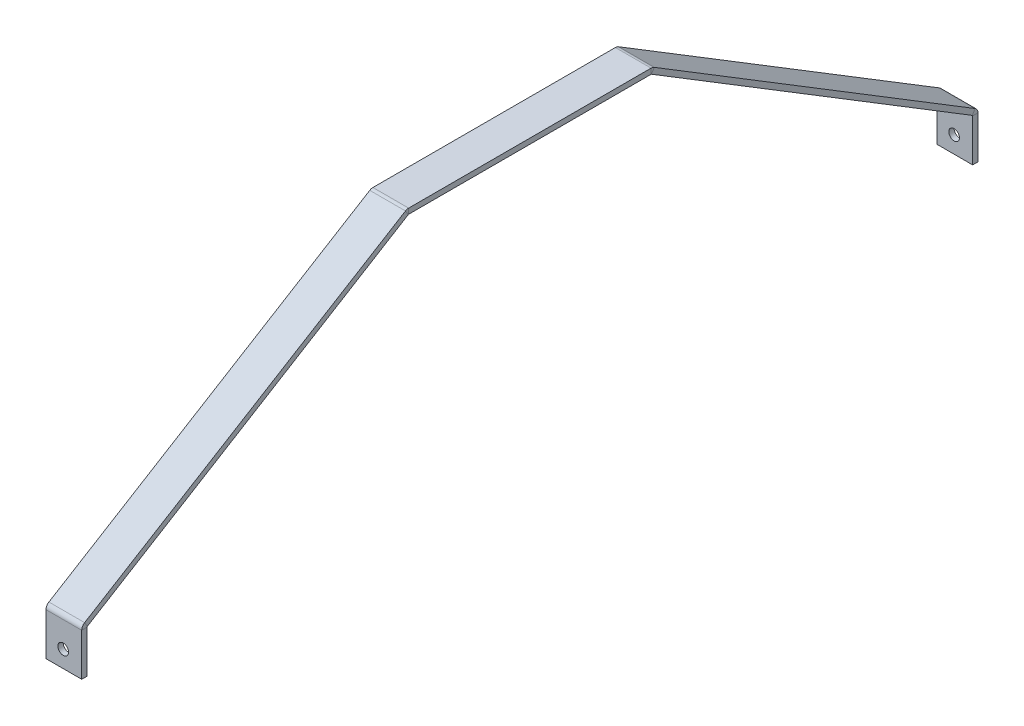
ISO-10303-21;
HEADER;
FILE_DESCRIPTION(('STEP AP214'),'2;1');
FILE_NAME('part.step','',(''),(''),'','','');
FILE_SCHEMA(('AUTOMOTIVE_DESIGN { 1 0 10303 214 1 1 1 1 }'));
ENDSEC;
DATA;
#1=APPLICATION_CONTEXT('core data for automotive mechanical design processes');
#2=APPLICATION_PROTOCOL_DEFINITION('international standard','automotive_design',2000,#1);
#3=PRODUCT_CONTEXT('',#1,'mechanical');
#4=PRODUCT('Part','Part','',(#3));
#5=PRODUCT_RELATED_PRODUCT_CATEGORY('part','',(#4));
#6=PRODUCT_DEFINITION_FORMATION('','',#4);
#7=PRODUCT_DEFINITION_CONTEXT('part definition',#1,'design');
#8=PRODUCT_DEFINITION('design','',#6,#7);
#9=PRODUCT_DEFINITION_SHAPE('','',#8);
#10=(LENGTH_UNIT() NAMED_UNIT(*) SI_UNIT(.MILLI.,.METRE.));
#11=(NAMED_UNIT(*) PLANE_ANGLE_UNIT() SI_UNIT($,.RADIAN.));
#12=(NAMED_UNIT(*) SI_UNIT($,.STERADIAN.) SOLID_ANGLE_UNIT());
#13=UNCERTAINTY_MEASURE_WITH_UNIT(LENGTH_MEASURE(1.E-05),#10,'distance_accuracy_value','');
#14=(GEOMETRIC_REPRESENTATION_CONTEXT(3) GLOBAL_UNCERTAINTY_ASSIGNED_CONTEXT((#13)) GLOBAL_UNIT_ASSIGNED_CONTEXT((#10,
#11,#12)) REPRESENTATION_CONTEXT('',''));
#15=CARTESIAN_POINT('',(0.,0.,0.));
#16=DIRECTION('',(0.,0.,1.));
#17=DIRECTION('',(1.,0.,0.));
#18=AXIS2_PLACEMENT_3D('',#15,#16,#17);
#19=CARTESIAN_POINT('',(10.,-54.941510556711,-123.904290001891));
#20=DIRECTION('',(1.,0.,0.));
#21=DIRECTION('',(0.,0.,-1.));
#22=AXIS2_PLACEMENT_3D('',#19,#20,#21);
#23=PLANE('',#22);
#24=DIRECTION('',(0.,0.853281833651962,-0.52145000945397));
#25=VECTOR('',#24,1.);
#26=CARTESIAN_POINT('',(10.,-54.941510556711,-123.904290001891));
#27=LINE('',#26,#25);
#28=CARTESIAN_POINT('',(10.,-54.941510556711,-123.904290001891));
#29=VERTEX_POINT('',#28);
#30=CARTESIAN_POINT('',(10.,-53.6615878062331,-124.686465016072));
#31=VERTEX_POINT('',#30);
#32=EDGE_CURVE('E11',#29,#31,#27,.T.);
#33=ORIENTED_EDGE('',*,*,#32,.F.);
#34=CARTESIAN_POINT('',(10.,-55.1121669234414,-123.8));
#35=DIRECTION('',(-1.,0.,0.));
#36=DIRECTION('',(0.,0.,1.));
#37=AXIS2_PLACEMENT_3D('',#34,#35,#36);
#38=CIRCLE('',#37,0.2);
#39=CARTESIAN_POINT('',(10.,-55.1121669234414,-124.));
#40=VERTEX_POINT('',#39);
#41=EDGE_CURVE('E366',#40,#29,#38,.F.);
#42=ORIENTED_EDGE('',*,*,#41,.F.);
#43=DIRECTION('',(0.,0.,1.));
#44=VECTOR('',#43,1.);
#45=CARTESIAN_POINT('',(10.,-55.1121669234414,-125.5));
#46=LINE('',#45,#44);
#47=CARTESIAN_POINT('',(10.,-55.1121669234414,-125.5));
#48=VERTEX_POINT('',#47);
#49=EDGE_CURVE('E44',#48,#40,#46,.T.);
#50=ORIENTED_EDGE('',*,*,#49,.F.);
#51=CARTESIAN_POINT('',(10.,-55.1121669234414,-123.8));
#52=DIRECTION('',(1.,0.,0.));
#53=DIRECTION('',(0.,0.,-1.));
#54=AXIS2_PLACEMENT_3D('',#51,#52,#53);
#55=CIRCLE('',#54,1.7);
#56=EDGE_CURVE('E379',#48,#31,#55,.T.);
#57=ORIENTED_EDGE('',*,*,#56,.T.);
#58=EDGE_LOOP('',(#33,#42,#50,#57));
#59=FACE_BOUND('',#58,.T.);
#60=ADVANCED_FACE('F36',(#59),#23,.T.);
#61=CARTESIAN_POINT('',(10.,-55.1121669234414,-125.5));
#62=DIRECTION('',(1.,0.,0.));
#63=DIRECTION('',(0.,0.,-1.));
#64=AXIS2_PLACEMENT_3D('',#61,#62,#63);
#65=PLANE('',#64);
#66=DIRECTION('',(0.,0.521450009453975,0.853281833651959));
#67=VECTOR('',#66,1.);
#68=CARTESIAN_POINT('',(10.,0.,-34.));
#69=LINE('',#68,#67);
#70=CARTESIAN_POINT('',(10.,-0.029343633269607,-34.0480168544412));
#71=VERTEX_POINT('',#70);
#72=EDGE_CURVE('E370',#29,#71,#69,.T.);
#73=ORIENTED_EDGE('',*,*,#72,.F.);
#74=ORIENTED_EDGE('',*,*,#32,.T.);
#75=DIRECTION('',(0.,0.521450009453975,0.853281833651959));
#76=VECTOR('',#75,1.);
#77=CARTESIAN_POINT('',(10.,1.27992275047794,-34.782175014181));
#78=LINE('',#77,#76);
#79=CARTESIAN_POINT('',(10.,1.25057911720834,-34.8301918686221));
#80=VERTEX_POINT('',#79);
#81=EDGE_CURVE('E381',#31,#80,#78,.T.);
#82=ORIENTED_EDGE('',*,*,#81,.T.);
#83=DIRECTION('',(0.,-0.853281833651964,0.521450009453967));
#84=VECTOR('',#83,1.);
#85=CARTESIAN_POINT('',(10.,1.25057911720834,-34.8301918686221));
#86=LINE('',#85,#84);
#87=EDGE_CURVE('E340',#80,#71,#86,.T.);
#88=ORIENTED_EDGE('',*,*,#87,.T.);
#89=EDGE_LOOP('',(#73,#74,#82,#88));
#90=FACE_BOUND('',#89,.T.);
#91=ADVANCED_FACE('F451',(#90),#65,.T.);
#92=CARTESIAN_POINT('',(0.,-55.1121669234414,-124.));
#93=DIRECTION('',(-1.,0.,0.));
#94=DIRECTION('',(0.,0.,1.));
#95=AXIS2_PLACEMENT_3D('',#92,#93,#94);
#96=PLANE('',#95);
#97=DIRECTION('',(0.,0.,-1.));
#98=VECTOR('',#97,1.);
#99=CARTESIAN_POINT('',(0.,-55.1121669234414,-124.));
#100=LINE('',#99,#98);
#101=CARTESIAN_POINT('',(0.,-55.1121669234414,-124.));
#102=VERTEX_POINT('',#101);
#103=CARTESIAN_POINT('',(0.,-55.1121669234414,-125.5));
#104=VERTEX_POINT('',#103);
#105=EDGE_CURVE('E346',#102,#104,#100,.T.);
#106=ORIENTED_EDGE('',*,*,#105,.F.);
#107=CARTESIAN_POINT('',(0.,-55.1121669234414,-123.8));
#108=DIRECTION('',(-1.,0.,0.));
#109=DIRECTION('',(0.,0.,1.));
#110=AXIS2_PLACEMENT_3D('',#107,#108,#109);
#111=CIRCLE('',#110,0.2);
#112=CARTESIAN_POINT('',(0.,-54.941510556711,-123.904290001891));
#113=VERTEX_POINT('',#112);
#114=EDGE_CURVE('E250',#102,#113,#111,.F.);
#115=ORIENTED_EDGE('',*,*,#114,.T.);
#116=DIRECTION('',(0.,-0.853281833651962,0.52145000945397));
#117=VECTOR('',#116,1.);
#118=CARTESIAN_POINT('',(0.,-53.6615878062331,-124.686465016072));
#119=LINE('',#118,#117);
#120=CARTESIAN_POINT('',(0.,-53.6615878062331,-124.686465016072));
#121=VERTEX_POINT('',#120);
#122=EDGE_CURVE('E344',#121,#113,#119,.T.);
#123=ORIENTED_EDGE('',*,*,#122,.F.);
#124=CARTESIAN_POINT('',(0.,-55.1121669234414,-123.8));
#125=DIRECTION('',(1.,0.,0.));
#126=DIRECTION('',(0.,0.,-1.));
#127=AXIS2_PLACEMENT_3D('',#124,#125,#126);
#128=CIRCLE('',#127,1.7);
#129=EDGE_CURVE('E262',#104,#121,#128,.T.);
#130=ORIENTED_EDGE('',*,*,#129,.F.);
#131=EDGE_LOOP('',(#106,#115,#123,#130));
#132=FACE_BOUND('',#131,.T.);
#133=ADVANCED_FACE('F493',(#132),#96,.T.);
#134=CARTESIAN_POINT('',(0.,-53.6615878062331,-124.686465016072));
#135=DIRECTION('',(-1.,0.,0.));
#136=DIRECTION('',(0.,0.,1.));
#137=AXIS2_PLACEMENT_3D('',#134,#135,#136);
#138=PLANE('',#137);
#139=DIRECTION('',(0.,1.,0.));
#140=VECTOR('',#139,1.);
#141=CARTESIAN_POINT('',(0.,-55.,-124.));
#142=LINE('',#141,#140);
#143=CARTESIAN_POINT('',(0.,-67.,-124.));
#144=VERTEX_POINT('',#143);
#145=EDGE_CURVE('E253',#144,#102,#142,.T.);
#146=ORIENTED_EDGE('',*,*,#145,.T.);
#147=ORIENTED_EDGE('',*,*,#105,.T.);
#148=DIRECTION('',(0.,1.,0.));
#149=VECTOR('',#148,1.);
#150=CARTESIAN_POINT('',(0.,-55.,-125.5));
#151=LINE('',#150,#149);
#152=CARTESIAN_POINT('',(0.,-67.,-125.5));
#153=VERTEX_POINT('',#152);
#154=EDGE_CURVE('E259',#153,#104,#151,.T.);
#155=ORIENTED_EDGE('',*,*,#154,.F.);
#156=DIRECTION('',(0.,0.,1.));
#157=VECTOR('',#156,1.);
#158=CARTESIAN_POINT('',(0.,-67.,-125.5));
#159=LINE('',#158,#157);
#160=EDGE_CURVE('E256',#153,#144,#159,.T.);
#161=ORIENTED_EDGE('',*,*,#160,.T.);
#162=EDGE_LOOP('',(#146,#147,#155,#161));
#163=FACE_BOUND('',#162,.T.);
#164=ADVANCED_FACE('F497',(#163),#138,.T.);
#165=CARTESIAN_POINT('',(10.,0.,-33.9437268525504));
#166=DIRECTION('',(1.,0.,0.));
#167=DIRECTION('',(0.,0.,-1.));
#168=AXIS2_PLACEMENT_3D('',#165,#166,#167);
#169=PLANE('',#168);
#170=DIRECTION('',(0.,1.,0.));
#171=VECTOR('',#170,1.);
#172=CARTESIAN_POINT('',(10.,0.,-33.9437268525504));
#173=LINE('',#172,#171);
#174=CARTESIAN_POINT('',(10.,0.,-33.9437268525504));
#175=VERTEX_POINT('',#174);
#176=CARTESIAN_POINT('',(10.,1.5,-33.9437268525504));
#177=VERTEX_POINT('',#176);
#178=EDGE_CURVE('E342',#175,#177,#173,.T.);
#179=ORIENTED_EDGE('',*,*,#178,.F.);
#180=CARTESIAN_POINT('',(10.,-0.199999999999999,-33.9437268525504));
#181=DIRECTION('',(-1.,0.,0.));
#182=DIRECTION('',(0.,0.,1.));
#183=AXIS2_PLACEMENT_3D('',#180,#181,#182);
#184=CIRCLE('',#183,0.2);
#185=EDGE_CURVE('E441',#71,#175,#184,.F.);
#186=ORIENTED_EDGE('',*,*,#185,.F.);
#187=ORIENTED_EDGE('',*,*,#87,.F.);
#188=CARTESIAN_POINT('',(10.,-0.199999999999999,-33.9437268525504));
#189=DIRECTION('',(1.,0.,0.));
#190=DIRECTION('',(0.,0.,-1.));
#191=AXIS2_PLACEMENT_3D('',#188,#189,#190);
#192=CIRCLE('',#191,1.7);
#193=EDGE_CURVE('E384',#80,#177,#192,.T.);
#194=ORIENTED_EDGE('',*,*,#193,.T.);
#195=EDGE_LOOP('',(#179,#186,#187,#194));
#196=FACE_BOUND('',#195,.T.);
#197=ADVANCED_FACE('F458',(#196),#169,.T.);
#198=CARTESIAN_POINT('',(10.,1.25057911720834,-34.8301918686221));
#199=DIRECTION('',(1.,0.,0.));
#200=DIRECTION('',(0.,0.,-1.));
#201=AXIS2_PLACEMENT_3D('',#198,#199,#200);
#202=PLANE('',#201);
#203=DIRECTION('',(0.,0.,1.));
#204=VECTOR('',#203,1.);
#205=CARTESIAN_POINT('',(10.,0.,-34.));
#206=LINE('',#205,#204);
#207=CARTESIAN_POINT('',(10.,0.,33.9437268525504));
#208=VERTEX_POINT('',#207);
#209=EDGE_CURVE('E438',#175,#208,#206,.T.);
#210=ORIENTED_EDGE('',*,*,#209,.F.);
#211=ORIENTED_EDGE('',*,*,#178,.T.);
#212=DIRECTION('',(0.,0.,1.));
#213=VECTOR('',#212,1.);
#214=CARTESIAN_POINT('',(10.,1.5,-34.));
#215=LINE('',#214,#213);
#216=CARTESIAN_POINT('',(10.,1.49999999999999,33.9437268525504));
#217=VERTEX_POINT('',#216);
#218=EDGE_CURVE('E203',#177,#217,#215,.T.);
#219=ORIENTED_EDGE('',*,*,#218,.T.);
#220=DIRECTION('',(0.,-1.,0.));
#221=VECTOR('',#220,1.);
#222=CARTESIAN_POINT('',(10.,1.49999999999999,33.9437268525504));
#223=LINE('',#222,#221);
#224=EDGE_CURVE('E194',#217,#208,#223,.T.);
#225=ORIENTED_EDGE('',*,*,#224,.T.);
#226=EDGE_LOOP('',(#210,#211,#219,#225));
#227=FACE_BOUND('',#226,.T.);
#228=ADVANCED_FACE('F390',(#227),#202,.T.);
#229=CARTESIAN_POINT('',(0.,-0.029343633269607,-34.0480168544412));
#230=DIRECTION('',(-1.,0.,0.));
#231=DIRECTION('',(0.,0.,1.));
#232=AXIS2_PLACEMENT_3D('',#229,#230,#231);
#233=PLANE('',#232);
#234=DIRECTION('',(0.,0.853281833651964,-0.521450009453967));
#235=VECTOR('',#234,1.);
#236=CARTESIAN_POINT('',(0.,-0.029343633269607,-34.0480168544412));
#237=LINE('',#236,#235);
#238=CARTESIAN_POINT('',(0.,-0.029343633269607,-34.0480168544412));
#239=VERTEX_POINT('',#238);
#240=CARTESIAN_POINT('',(0.,1.25057911720834,-34.8301918686221));
#241=VERTEX_POINT('',#240);
#242=EDGE_CURVE('E338',#239,#241,#237,.T.);
#243=ORIENTED_EDGE('',*,*,#242,.F.);
#244=CARTESIAN_POINT('',(0.,-0.199999999999999,-33.9437268525504));
#245=DIRECTION('',(-1.,0.,0.));
#246=DIRECTION('',(0.,0.,1.));
#247=AXIS2_PLACEMENT_3D('',#244,#245,#246);
#248=CIRCLE('',#247,0.2);
#249=CARTESIAN_POINT('',(0.,0.,-33.9437268525504));
#250=VERTEX_POINT('',#249);
#251=EDGE_CURVE('E244',#239,#250,#248,.F.);
#252=ORIENTED_EDGE('',*,*,#251,.T.);
#253=DIRECTION('',(0.,-1.,0.));
#254=VECTOR('',#253,1.);
#255=CARTESIAN_POINT('',(0.,1.5,-33.9437268525504));
#256=LINE('',#255,#254);
#257=CARTESIAN_POINT('',(0.,1.5,-33.9437268525504));
#258=VERTEX_POINT('',#257);
#259=EDGE_CURVE('E193',#258,#250,#256,.T.);
#260=ORIENTED_EDGE('',*,*,#259,.F.);
#261=CARTESIAN_POINT('',(0.,-0.199999999999999,-33.9437268525504));
#262=DIRECTION('',(1.,0.,0.));
#263=DIRECTION('',(0.,0.,-1.));
#264=AXIS2_PLACEMENT_3D('',#261,#262,#263);
#265=CIRCLE('',#264,1.7);
#266=EDGE_CURVE('E268',#241,#258,#265,.T.);
#267=ORIENTED_EDGE('',*,*,#266,.F.);
#268=EDGE_LOOP('',(#243,#252,#260,#267));
#269=FACE_BOUND('',#268,.T.);
#270=ADVANCED_FACE('F467',(#269),#233,.T.);
#271=CARTESIAN_POINT('',(0.,1.5,-33.9437268525504));
#272=DIRECTION('',(-1.,0.,0.));
#273=DIRECTION('',(0.,0.,1.));
#274=AXIS2_PLACEMENT_3D('',#271,#272,#273);
#275=PLANE('',#274);
#276=DIRECTION('',(0.,0.521450009453975,0.853281833651959));
#277=VECTOR('',#276,1.);
#278=CARTESIAN_POINT('',(0.,0.,-34.));
#279=LINE('',#278,#277);
#280=EDGE_CURVE('E247',#113,#239,#279,.T.);
#281=ORIENTED_EDGE('',*,*,#280,.T.);
#282=ORIENTED_EDGE('',*,*,#242,.T.);
#283=DIRECTION('',(0.,0.521450009453975,0.853281833651959));
#284=VECTOR('',#283,1.);
#285=CARTESIAN_POINT('',(0.,1.27992275047794,-34.782175014181));
#286=LINE('',#285,#284);
#287=EDGE_CURVE('E265',#121,#241,#286,.T.);
#288=ORIENTED_EDGE('',*,*,#287,.F.);
#289=ORIENTED_EDGE('',*,*,#122,.T.);
#290=EDGE_LOOP('',(#281,#282,#288,#289));
#291=FACE_BOUND('',#290,.T.);
#292=ADVANCED_FACE('F471',(#291),#275,.T.);
#293=CARTESIAN_POINT('',(10.,-0.0293436332696236,34.0480168544412));
#294=DIRECTION('',(1.,0.,0.));
#295=DIRECTION('',(0.,0.,-1.));
#296=AXIS2_PLACEMENT_3D('',#293,#294,#295);
#297=PLANE('',#296);
#298=DIRECTION('',(0.,0.853281833651958,0.521450009453976));
#299=VECTOR('',#298,1.);
#300=CARTESIAN_POINT('',(10.,-0.0293436332696236,34.0480168544412));
#301=LINE('',#300,#299);
#302=CARTESIAN_POINT('',(10.,-0.0293436332696236,34.0480168544412));
#303=VERTEX_POINT('',#302);
#304=CARTESIAN_POINT('',(10.,1.25057911720831,34.8301918686222));
#305=VERTEX_POINT('',#304);
#306=EDGE_CURVE('E181',#303,#305,#301,.T.);
#307=ORIENTED_EDGE('',*,*,#306,.F.);
#308=CARTESIAN_POINT('',(10.,-0.200000000000013,33.9437268525504));
#309=DIRECTION('',(-1.,0.,0.));
#310=DIRECTION('',(0.,0.,1.));
#311=AXIS2_PLACEMENT_3D('',#308,#309,#310);
#312=CIRCLE('',#311,0.2);
#313=EDGE_CURVE('E402',#208,#303,#312,.F.);
#314=ORIENTED_EDGE('',*,*,#313,.F.);
#315=ORIENTED_EDGE('',*,*,#224,.F.);
#316=CARTESIAN_POINT('',(10.,-0.200000000000013,33.9437268525504));
#317=DIRECTION('',(1.,0.,0.));
#318=DIRECTION('',(0.,0.,-1.));
#319=AXIS2_PLACEMENT_3D('',#316,#317,#318);
#320=CIRCLE('',#319,1.7);
#321=EDGE_CURVE('E197',#217,#305,#320,.T.);
#322=ORIENTED_EDGE('',*,*,#321,.T.);
#323=EDGE_LOOP('',(#307,#314,#315,#322));
#324=FACE_BOUND('',#323,.T.);
#325=ADVANCED_FACE('F199',(#324),#297,.T.);
#326=CARTESIAN_POINT('',(10.,1.49999999999999,33.9437268525504));
#327=DIRECTION('',(1.,0.,0.));
#328=DIRECTION('',(0.,0.,-1.));
#329=AXIS2_PLACEMENT_3D('',#326,#327,#328);
#330=PLANE('',#329);
#331=DIRECTION('',(0.,-0.521450009453975,0.853281833651959));
#332=VECTOR('',#331,1.);
#333=CARTESIAN_POINT('',(10.,0.,34.));
#334=LINE('',#333,#332);
#335=CARTESIAN_POINT('',(10.,-54.941510556711,123.904290001891));
#336=VERTEX_POINT('',#335);
#337=EDGE_CURVE('E188',#303,#336,#334,.T.);
#338=ORIENTED_EDGE('',*,*,#337,.F.);
#339=ORIENTED_EDGE('',*,*,#306,.T.);
#340=DIRECTION('',(0.,-0.521450009453975,0.853281833651959));
#341=VECTOR('',#340,1.);
#342=CARTESIAN_POINT('',(10.,1.27992275047793,34.782175014181));
#343=LINE('',#342,#341);
#344=CARTESIAN_POINT('',(10.,-53.6615878062331,124.686465016072));
#345=VERTEX_POINT('',#344);
#346=EDGE_CURVE('E185',#305,#345,#343,.T.);
#347=ORIENTED_EDGE('',*,*,#346,.T.);
#348=DIRECTION('',(0.,-0.853281833651974,-0.521450009453951));
#349=VECTOR('',#348,1.);
#350=CARTESIAN_POINT('',(10.,-53.6615878062331,124.686465016072));
#351=LINE('',#350,#349);
#352=EDGE_CURVE('E329',#345,#336,#351,.T.);
#353=ORIENTED_EDGE('',*,*,#352,.T.);
#354=EDGE_LOOP('',(#338,#339,#347,#353));
#355=FACE_BOUND('',#354,.T.);
#356=ADVANCED_FACE('F183',(#355),#330,.T.);
#357=CARTESIAN_POINT('',(0.,0.,33.9437268525504));
#358=DIRECTION('',(-1.,0.,0.));
#359=DIRECTION('',(0.,0.,1.));
#360=AXIS2_PLACEMENT_3D('',#357,#358,#359);
#361=PLANE('',#360);
#362=DIRECTION('',(0.,1.,0.));
#363=VECTOR('',#362,1.);
#364=CARTESIAN_POINT('',(0.,0.,33.9437268525504));
#365=LINE('',#364,#363);
#366=CARTESIAN_POINT('',(0.,0.,33.9437268525504));
#367=VERTEX_POINT('',#366);
#368=CARTESIAN_POINT('',(0.,1.49999999999999,33.9437268525504));
#369=VERTEX_POINT('',#368);
#370=EDGE_CURVE('E334',#367,#369,#365,.T.);
#371=ORIENTED_EDGE('',*,*,#370,.F.);
#372=CARTESIAN_POINT('',(0.,-0.200000000000013,33.9437268525504));
#373=DIRECTION('',(-1.,0.,0.));
#374=DIRECTION('',(0.,0.,1.));
#375=AXIS2_PLACEMENT_3D('',#372,#373,#374);
#376=CIRCLE('',#375,0.2);
#377=CARTESIAN_POINT('',(0.,-0.0293436332696236,34.0480168544412));
#378=VERTEX_POINT('',#377);
#379=EDGE_CURVE('E238',#367,#378,#376,.F.);
#380=ORIENTED_EDGE('',*,*,#379,.T.);
#381=DIRECTION('',(0.,-0.853281833651958,-0.521450009453976));
#382=VECTOR('',#381,1.);
#383=CARTESIAN_POINT('',(0.,1.25057911720831,34.8301918686222));
#384=LINE('',#383,#382);
#385=CARTESIAN_POINT('',(0.,1.25057911720831,34.8301918686222));
#386=VERTEX_POINT('',#385);
#387=EDGE_CURVE('E332',#386,#378,#384,.T.);
#388=ORIENTED_EDGE('',*,*,#387,.F.);
#389=CARTESIAN_POINT('',(0.,-0.200000000000013,33.9437268525504));
#390=DIRECTION('',(1.,0.,0.));
#391=DIRECTION('',(0.,0.,-1.));
#392=AXIS2_PLACEMENT_3D('',#389,#390,#391);
#393=CIRCLE('',#392,1.7);
#394=EDGE_CURVE('E210',#369,#386,#393,.T.);
#395=ORIENTED_EDGE('',*,*,#394,.F.);
#396=EDGE_LOOP('',(#371,#380,#388,#395));
#397=FACE_BOUND('',#396,.T.);
#398=ADVANCED_FACE('F396',(#397),#361,.T.);
#399=CARTESIAN_POINT('',(0.,1.25057911720831,34.8301918686222));
#400=DIRECTION('',(-1.,0.,0.));
#401=DIRECTION('',(0.,0.,1.));
#402=AXIS2_PLACEMENT_3D('',#399,#400,#401);
#403=PLANE('',#402);
#404=DIRECTION('',(0.,0.,1.));
#405=VECTOR('',#404,1.);
#406=CARTESIAN_POINT('',(0.,0.,-34.));
#407=LINE('',#406,#405);
#408=EDGE_CURVE('E241',#250,#367,#407,.T.);
#409=ORIENTED_EDGE('',*,*,#408,.T.);
#410=ORIENTED_EDGE('',*,*,#370,.T.);
#411=DIRECTION('',(0.,0.,1.));
#412=VECTOR('',#411,1.);
#413=CARTESIAN_POINT('',(0.,1.5,-34.));
#414=LINE('',#413,#412);
#415=EDGE_CURVE('E271',#258,#369,#414,.T.);
#416=ORIENTED_EDGE('',*,*,#415,.F.);
#417=ORIENTED_EDGE('',*,*,#259,.T.);
#418=EDGE_LOOP('',(#409,#410,#416,#417));
#419=FACE_BOUND('',#418,.T.);
#420=ADVANCED_FACE('F477',(#419),#403,.T.);
#421=CARTESIAN_POINT('',(10.,-55.1121669234414,124.));
#422=DIRECTION('',(1.,0.,0.));
#423=DIRECTION('',(0.,0.,-1.));
#424=AXIS2_PLACEMENT_3D('',#421,#422,#423);
#425=PLANE('',#424);
#426=DIRECTION('',(0.,0.,1.));
#427=VECTOR('',#426,1.);
#428=CARTESIAN_POINT('',(10.,-55.1121669234414,124.));
#429=LINE('',#428,#427);
#430=CARTESIAN_POINT('',(10.,-55.1121669234414,124.));
#431=VERTEX_POINT('',#430);
#432=CARTESIAN_POINT('',(10.,-55.1121669234414,125.5));
#433=VERTEX_POINT('',#432);
#434=EDGE_CURVE('E52',#431,#433,#429,.T.);
#435=ORIENTED_EDGE('',*,*,#434,.F.);
#436=CARTESIAN_POINT('',(10.,-55.1121669234414,123.8));
#437=DIRECTION('',(-1.,0.,0.));
#438=DIRECTION('',(0.,0.,1.));
#439=AXIS2_PLACEMENT_3D('',#436,#437,#438);
#440=CIRCLE('',#439,0.2);
#441=EDGE_CURVE('E430',#336,#431,#440,.F.);
#442=ORIENTED_EDGE('',*,*,#441,.F.);
#443=ORIENTED_EDGE('',*,*,#352,.F.);
#444=CARTESIAN_POINT('',(10.,-55.1121669234414,123.8));
#445=DIRECTION('',(1.,0.,0.));
#446=DIRECTION('',(0.,0.,-1.));
#447=AXIS2_PLACEMENT_3D('',#444,#445,#446);
#448=CIRCLE('',#447,1.7);
#449=EDGE_CURVE('E218',#345,#433,#448,.T.);
#450=ORIENTED_EDGE('',*,*,#449,.T.);
#451=EDGE_LOOP('',(#435,#442,#443,#450));
#452=FACE_BOUND('',#451,.T.);
#453=ADVANCED_FACE('F479',(#452),#425,.T.);
#454=CARTESIAN_POINT('',(10.,-53.6615878062331,124.686465016072));
#455=DIRECTION('',(1.,0.,0.));
#456=DIRECTION('',(0.,0.,-1.));
#457=AXIS2_PLACEMENT_3D('',#454,#455,#456);
#458=PLANE('',#457);
#459=DIRECTION('',(0.,-1.,0.));
#460=VECTOR('',#459,1.);
#461=CARTESIAN_POINT('',(10.,-55.,124.));
#462=LINE('',#461,#460);
#463=CARTESIAN_POINT('',(10.,-67.,124.));
#464=VERTEX_POINT('',#463);
#465=EDGE_CURVE('E428',#431,#464,#462,.T.);
#466=ORIENTED_EDGE('',*,*,#465,.F.);
#467=ORIENTED_EDGE('',*,*,#434,.T.);
#468=DIRECTION('',(0.,1.,0.));
#469=VECTOR('',#468,1.);
#470=CARTESIAN_POINT('',(10.,-55.,125.5));
#471=LINE('',#470,#469);
#472=CARTESIAN_POINT('',(10.,-67.,125.5));
#473=VERTEX_POINT('',#472);
#474=EDGE_CURVE('E130',#433,#473,#471,.F.);
#475=ORIENTED_EDGE('',*,*,#474,.T.);
#476=DIRECTION('',(0.,0.,1.));
#477=VECTOR('',#476,1.);
#478=CARTESIAN_POINT('',(10.,-67.,124.));
#479=LINE('',#478,#477);
#480=EDGE_CURVE('E426',#464,#473,#479,.T.);
#481=ORIENTED_EDGE('',*,*,#480,.F.);
#482=EDGE_LOOP('',(#466,#467,#475,#481));
#483=FACE_BOUND('',#482,.T.);
#484=ADVANCED_FACE('F485',(#483),#458,.T.);
#485=CARTESIAN_POINT('',(0.,-54.941510556711,123.904290001891));
#486=DIRECTION('',(-1.,0.,0.));
#487=DIRECTION('',(0.,0.,1.));
#488=AXIS2_PLACEMENT_3D('',#485,#486,#487);
#489=PLANE('',#488);
#490=DIRECTION('',(0.,0.853281833651974,0.521450009453951));
#491=VECTOR('',#490,1.);
#492=CARTESIAN_POINT('',(0.,-54.941510556711,123.904290001891));
#493=LINE('',#492,#491);
#494=CARTESIAN_POINT('',(0.,-54.941510556711,123.904290001891));
#495=VERTEX_POINT('',#494);
#496=CARTESIAN_POINT('',(0.,-53.6615878062331,124.686465016072));
#497=VERTEX_POINT('',#496);
#498=EDGE_CURVE('E117',#495,#497,#493,.T.);
#499=ORIENTED_EDGE('',*,*,#498,.F.);
#500=CARTESIAN_POINT('',(0.,-55.1121669234414,123.8));
#501=DIRECTION('',(-1.,0.,0.));
#502=DIRECTION('',(0.,0.,1.));
#503=AXIS2_PLACEMENT_3D('',#500,#501,#502);
#504=CIRCLE('',#503,0.2);
#505=CARTESIAN_POINT('',(0.,-55.1121669234414,124.));
#506=VERTEX_POINT('',#505);
#507=EDGE_CURVE('E234',#495,#506,#504,.F.);
#508=ORIENTED_EDGE('',*,*,#507,.T.);
#509=DIRECTION('',(0.,0.,-1.));
#510=VECTOR('',#509,1.);
#511=CARTESIAN_POINT('',(0.,-55.1121669234414,125.5));
#512=LINE('',#511,#510);
#513=CARTESIAN_POINT('',(0.,-55.1121669234414,125.5));
#514=VERTEX_POINT('',#513);
#515=EDGE_CURVE('E124',#514,#506,#512,.T.);
#516=ORIENTED_EDGE('',*,*,#515,.F.);
#517=CARTESIAN_POINT('',(0.,-55.1121669234414,123.8));
#518=DIRECTION('',(1.,0.,0.));
#519=DIRECTION('',(0.,0.,-1.));
#520=AXIS2_PLACEMENT_3D('',#517,#518,#519);
#521=CIRCLE('',#520,1.7);
#522=EDGE_CURVE('E277',#497,#514,#521,.T.);
#523=ORIENTED_EDGE('',*,*,#522,.F.);
#524=EDGE_LOOP('',(#499,#508,#516,#523));
#525=FACE_BOUND('',#524,.T.);
#526=ADVANCED_FACE('F413',(#525),#489,.T.);
#527=CARTESIAN_POINT('',(0.,-55.1121669234414,125.5));
#528=DIRECTION('',(-1.,0.,0.));
#529=DIRECTION('',(0.,0.,1.));
#530=AXIS2_PLACEMENT_3D('',#527,#528,#529);
#531=PLANE('',#530);
#532=DIRECTION('',(0.,-0.521450009453975,0.853281833651959));
#533=VECTOR('',#532,1.);
#534=CARTESIAN_POINT('',(0.,0.,34.));
#535=LINE('',#534,#533);
#536=EDGE_CURVE('E236',#378,#495,#535,.T.);
#537=ORIENTED_EDGE('',*,*,#536,.T.);
#538=ORIENTED_EDGE('',*,*,#498,.T.);
#539=DIRECTION('',(0.,-0.521450009453975,0.853281833651959));
#540=VECTOR('',#539,1.);
#541=CARTESIAN_POINT('',(0.,1.27992275047793,34.782175014181));
#542=LINE('',#541,#540);
#543=EDGE_CURVE('E275',#386,#497,#542,.T.);
#544=ORIENTED_EDGE('',*,*,#543,.F.);
#545=ORIENTED_EDGE('',*,*,#387,.T.);
#546=EDGE_LOOP('',(#537,#538,#544,#545));
#547=FACE_BOUND('',#546,.T.);
#548=ADVANCED_FACE('F398',(#547),#531,.T.);
#549=CARTESIAN_POINT('',(10.,-55.,125.5));
#550=DIRECTION('',(0.,0.,-1.));
#551=DIRECTION('',(-1.,0.,0.));
#552=AXIS2_PLACEMENT_3D('',#549,#550,#551);
#553=PLANE('',#552);
#554=CARTESIAN_POINT('',(4.82317135708357,-62.280383367042,125.5));
#555=DIRECTION('',(0.,0.,1.));
#556=DIRECTION('',(1.,0.,0.));
#557=AXIS2_PLACEMENT_3D('',#554,#555,#556);
#558=CIRCLE('',#557,1.5);
#559=CARTESIAN_POINT('',(6.32317135708357,-62.280383367042,125.5));
#560=VERTEX_POINT('',#559);
#561=EDGE_CURVE('E901',#560,#560,#558,.T.);
#562=ORIENTED_EDGE('',*,*,#561,.F.);
#563=EDGE_LOOP('',(#562));
#564=FACE_BOUND('',#563,.T.);
#565=DIRECTION('',(0.,1.,0.));
#566=VECTOR('',#565,1.);
#567=CARTESIAN_POINT('',(0.,-55.,125.5));
#568=LINE('',#567,#566);
#569=CARTESIAN_POINT('',(0.,-67.,125.5));
#570=VERTEX_POINT('',#569);
#571=EDGE_CURVE('E224',#514,#570,#568,.F.);
#572=ORIENTED_EDGE('',*,*,#571,.T.);
#573=DIRECTION('',(-1.,0.,0.));
#574=VECTOR('',#573,1.);
#575=CARTESIAN_POINT('',(10.,-67.,125.5));
#576=LINE('',#575,#574);
#577=EDGE_CURVE('E325',#473,#570,#576,.T.);
#578=ORIENTED_EDGE('',*,*,#577,.F.);
#579=ORIENTED_EDGE('',*,*,#474,.F.);
#580=DIRECTION('',(-1.,0.,0.));
#581=VECTOR('',#580,1.);
#582=CARTESIAN_POINT('',(10.,-55.1121669234414,125.5));
#583=LINE('',#582,#581);
#584=EDGE_CURVE('E220',#433,#514,#583,.T.);
#585=ORIENTED_EDGE('',*,*,#584,.T.);
#586=EDGE_LOOP('',(#572,#578,#579,#585));
#587=FACE_BOUND('',#586,.T.);
#588=ADVANCED_FACE('F419',(#564,#587),#553,.F.);
#589=CARTESIAN_POINT('',(10.,-67.,124.));
#590=DIRECTION('',(0.,-1.,0.));
#591=DIRECTION('',(0.,0.,-1.));
#592=AXIS2_PLACEMENT_3D('',#589,#590,#591);
#593=PLANE('',#592);
#594=DIRECTION('',(0.,0.,1.));
#595=VECTOR('',#594,1.);
#596=CARTESIAN_POINT('',(0.,-67.,124.));
#597=LINE('',#596,#595);
#598=CARTESIAN_POINT('',(0.,-67.,124.));
#599=VERTEX_POINT('',#598);
#600=EDGE_CURVE('E227',#599,#570,#597,.T.);
#601=ORIENTED_EDGE('',*,*,#600,.F.);
#602=DIRECTION('',(-1.,0.,0.));
#603=VECTOR('',#602,1.);
#604=CARTESIAN_POINT('',(10.,-67.,124.));
#605=LINE('',#604,#603);
#606=EDGE_CURVE('E323',#464,#599,#605,.T.);
#607=ORIENTED_EDGE('',*,*,#606,.F.);
#608=ORIENTED_EDGE('',*,*,#480,.T.);
#609=ORIENTED_EDGE('',*,*,#577,.T.);
#610=EDGE_LOOP('',(#601,#607,#608,#609));
#611=FACE_BOUND('',#610,.T.);
#612=ADVANCED_FACE('F424',(#611),#593,.T.);
#613=CARTESIAN_POINT('',(10.,-55.,124.));
#614=DIRECTION('',(0.,0.,-1.));
#615=DIRECTION('',(-1.,0.,0.));
#616=AXIS2_PLACEMENT_3D('',#613,#614,#615);
#617=PLANE('',#616);
#618=CARTESIAN_POINT('',(4.82317135708357,-62.280383367042,124.));
#619=DIRECTION('',(0.,0.,-1.));
#620=DIRECTION('',(-1.,0.,0.));
#621=AXIS2_PLACEMENT_3D('',#618,#619,#620);
#622=CIRCLE('',#621,1.5);
#623=CARTESIAN_POINT('',(3.32317135708357,-62.280383367042,124.));
#624=VERTEX_POINT('',#623);
#625=EDGE_CURVE('E228',#624,#624,#622,.T.);
#626=ORIENTED_EDGE('',*,*,#625,.F.);
#627=EDGE_LOOP('',(#626));
#628=FACE_BOUND('',#627,.T.);
#629=DIRECTION('',(0.,-1.,0.));
#630=VECTOR('',#629,1.);
#631=CARTESIAN_POINT('',(0.,-55.,124.));
#632=LINE('',#631,#630);
#633=EDGE_CURVE('E231',#506,#599,#632,.T.);
#634=ORIENTED_EDGE('',*,*,#633,.F.);
#635=DIRECTION('',(-1.,0.,0.));
#636=VECTOR('',#635,1.);
#637=CARTESIAN_POINT('',(10.,-55.1121669234414,124.));
#638=LINE('',#637,#636);
#639=EDGE_CURVE('E320',#431,#506,#638,.T.);
#640=ORIENTED_EDGE('',*,*,#639,.F.);
#641=ORIENTED_EDGE('',*,*,#465,.T.);
#642=ORIENTED_EDGE('',*,*,#606,.T.);
#643=EDGE_LOOP('',(#634,#640,#641,#642));
#644=FACE_BOUND('',#643,.T.);
#645=ADVANCED_FACE('F574',(#628,#644),#617,.T.);
#646=CARTESIAN_POINT('',(10.,-55.1121669234414,123.8));
#647=DIRECTION('',(-1.,0.,0.));
#648=DIRECTION('',(0.,0.,1.));
#649=AXIS2_PLACEMENT_3D('',#646,#647,#648);
#650=CYLINDRICAL_SURFACE('',#649,0.2);
#651=ORIENTED_EDGE('',*,*,#507,.F.);
#652=DIRECTION('',(-1.,0.,0.));
#653=VECTOR('',#652,1.);
#654=CARTESIAN_POINT('',(10.,-54.941510556711,123.904290001891));
#655=LINE('',#654,#653);
#656=EDGE_CURVE('E317',#336,#495,#655,.T.);
#657=ORIENTED_EDGE('',*,*,#656,.F.);
#658=ORIENTED_EDGE('',*,*,#441,.T.);
#659=ORIENTED_EDGE('',*,*,#639,.T.);
#660=EDGE_LOOP('',(#651,#657,#658,#659));
#661=FACE_BOUND('',#660,.T.);
#662=ADVANCED_FACE('F410',(#661),#650,.F.);
#663=CARTESIAN_POINT('',(10.,0.,34.));
#664=DIRECTION('',(0.,-0.853281833651959,-0.521450009453975));
#665=DIRECTION('',(0.,0.521450009453975,-0.853281833651959));
#666=AXIS2_PLACEMENT_3D('',#663,#664,#665);
#667=PLANE('',#666);
#668=ORIENTED_EDGE('',*,*,#536,.F.);
#669=DIRECTION('',(-1.,0.,0.));
#670=VECTOR('',#669,1.);
#671=CARTESIAN_POINT('',(10.,-0.0293436332696236,34.0480168544412));
#672=LINE('',#671,#670);
#673=EDGE_CURVE('E314',#303,#378,#672,.T.);
#674=ORIENTED_EDGE('',*,*,#673,.F.);
#675=ORIENTED_EDGE('',*,*,#337,.T.);
#676=ORIENTED_EDGE('',*,*,#656,.T.);
#677=EDGE_LOOP('',(#668,#674,#675,#676));
#678=FACE_BOUND('',#677,.T.);
#679=ADVANCED_FACE('F404',(#678),#667,.T.);
#680=CARTESIAN_POINT('',(10.,-0.200000000000013,33.9437268525504));
#681=DIRECTION('',(-1.,0.,0.));
#682=DIRECTION('',(0.,0.,1.));
#683=AXIS2_PLACEMENT_3D('',#680,#681,#682);
#684=CYLINDRICAL_SURFACE('',#683,0.2);
#685=ORIENTED_EDGE('',*,*,#379,.F.);
#686=DIRECTION('',(-1.,0.,0.));
#687=VECTOR('',#686,1.);
#688=CARTESIAN_POINT('',(10.,0.,33.9437268525504));
#689=LINE('',#688,#687);
#690=EDGE_CURVE('E311',#208,#367,#689,.T.);
#691=ORIENTED_EDGE('',*,*,#690,.F.);
#692=ORIENTED_EDGE('',*,*,#313,.T.);
#693=ORIENTED_EDGE('',*,*,#673,.T.);
#694=EDGE_LOOP('',(#685,#691,#692,#693));
#695=FACE_BOUND('',#694,.T.);
#696=ADVANCED_FACE('F401',(#695),#684,.F.);
#697=CARTESIAN_POINT('',(10.,0.,-34.));
#698=DIRECTION('',(0.,-1.,0.));
#699=DIRECTION('',(0.,0.,-1.));
#700=AXIS2_PLACEMENT_3D('',#697,#698,#699);
#701=PLANE('',#700);
#702=ORIENTED_EDGE('',*,*,#408,.F.);
#703=DIRECTION('',(-1.,0.,0.));
#704=VECTOR('',#703,1.);
#705=CARTESIAN_POINT('',(10.,0.,-33.9437268525504));
#706=LINE('',#705,#704);
#707=EDGE_CURVE('E308',#175,#250,#706,.T.);
#708=ORIENTED_EDGE('',*,*,#707,.F.);
#709=ORIENTED_EDGE('',*,*,#209,.T.);
#710=ORIENTED_EDGE('',*,*,#690,.T.);
#711=EDGE_LOOP('',(#702,#708,#709,#710));
#712=FACE_BOUND('',#711,.T.);
#713=ADVANCED_FACE('F464',(#712),#701,.T.);
#714=CARTESIAN_POINT('',(10.,-0.199999999999999,-33.9437268525504));
#715=DIRECTION('',(-1.,0.,0.));
#716=DIRECTION('',(0.,0.,1.));
#717=AXIS2_PLACEMENT_3D('',#714,#715,#716);
#718=CYLINDRICAL_SURFACE('',#717,0.2);
#719=ORIENTED_EDGE('',*,*,#251,.F.);
#720=DIRECTION('',(-1.,0.,0.));
#721=VECTOR('',#720,1.);
#722=CARTESIAN_POINT('',(10.,-0.029343633269607,-34.0480168544412));
#723=LINE('',#722,#721);
#724=EDGE_CURVE('E305',#71,#239,#723,.T.);
#725=ORIENTED_EDGE('',*,*,#724,.F.);
#726=ORIENTED_EDGE('',*,*,#185,.T.);
#727=ORIENTED_EDGE('',*,*,#707,.T.);
#728=EDGE_LOOP('',(#719,#725,#726,#727));
#729=FACE_BOUND('',#728,.T.);
#730=ADVANCED_FACE('F457',(#729),#718,.F.);
#731=CARTESIAN_POINT('',(10.,0.,-34.));
#732=DIRECTION('',(0.,-0.853281833651959,0.521450009453975));
#733=DIRECTION('',(0.,-0.521450009453975,-0.853281833651959));
#734=AXIS2_PLACEMENT_3D('',#731,#732,#733);
#735=PLANE('',#734);
#736=ORIENTED_EDGE('',*,*,#280,.F.);
#737=DIRECTION('',(-1.,0.,0.));
#738=VECTOR('',#737,1.);
#739=CARTESIAN_POINT('',(10.,-54.941510556711,-123.904290001891));
#740=LINE('',#739,#738);
#741=EDGE_CURVE('E302',#29,#113,#740,.T.);
#742=ORIENTED_EDGE('',*,*,#741,.F.);
#743=ORIENTED_EDGE('',*,*,#72,.T.);
#744=ORIENTED_EDGE('',*,*,#724,.T.);
#745=EDGE_LOOP('',(#736,#742,#743,#744));
#746=FACE_BOUND('',#745,.T.);
#747=ADVANCED_FACE('F447',(#746),#735,.T.);
#748=CARTESIAN_POINT('',(10.,-55.1121669234414,-123.8));
#749=DIRECTION('',(-1.,0.,0.));
#750=DIRECTION('',(0.,0.,1.));
#751=AXIS2_PLACEMENT_3D('',#748,#749,#750);
#752=CYLINDRICAL_SURFACE('',#751,0.2);
#753=ORIENTED_EDGE('',*,*,#114,.F.);
#754=DIRECTION('',(-1.,0.,0.));
#755=VECTOR('',#754,1.);
#756=CARTESIAN_POINT('',(10.,-55.1121669234414,-124.));
#757=LINE('',#756,#755);
#758=EDGE_CURVE('E299',#40,#102,#757,.T.);
#759=ORIENTED_EDGE('',*,*,#758,.F.);
#760=ORIENTED_EDGE('',*,*,#41,.T.);
#761=ORIENTED_EDGE('',*,*,#741,.T.);
#762=EDGE_LOOP('',(#753,#759,#760,#761));
#763=FACE_BOUND('',#762,.T.);
#764=ADVANCED_FACE('F365',(#763),#752,.F.);
#765=CARTESIAN_POINT('',(10.,-55.,-124.));
#766=DIRECTION('',(0.,0.,1.));
#767=DIRECTION('',(0.,-1.,0.));
#768=AXIS2_PLACEMENT_3D('',#765,#766,#767);
#769=PLANE('',#768);
#770=CARTESIAN_POINT('',(4.82317135708357,-62.280383367042,-124.));
#771=DIRECTION('',(0.,0.,1.));
#772=DIRECTION('',(0.,-1.,0.));
#773=AXIS2_PLACEMENT_3D('',#770,#771,#772);
#774=CIRCLE('',#773,1.5);
#775=CARTESIAN_POINT('',(4.82317135708357,-63.780383367042,-124.));
#776=VERTEX_POINT('',#775);
#777=EDGE_CURVE('E905',#776,#776,#774,.T.);
#778=ORIENTED_EDGE('',*,*,#777,.F.);
#779=EDGE_LOOP('',(#778));
#780=FACE_BOUND('',#779,.T.);
#781=ORIENTED_EDGE('',*,*,#145,.F.);
#782=DIRECTION('',(-1.,0.,0.));
#783=VECTOR('',#782,1.);
#784=CARTESIAN_POINT('',(10.,-67.,-124.));
#785=LINE('',#784,#783);
#786=CARTESIAN_POINT('',(10.,-67.,-124.));
#787=VERTEX_POINT('',#786);
#788=EDGE_CURVE('E297',#787,#144,#785,.T.);
#789=ORIENTED_EDGE('',*,*,#788,.F.);
#790=DIRECTION('',(0.,1.,0.));
#791=VECTOR('',#790,1.);
#792=CARTESIAN_POINT('',(10.,-55.,-124.));
#793=LINE('',#792,#791);
#794=EDGE_CURVE('E354',#787,#40,#793,.T.);
#795=ORIENTED_EDGE('',*,*,#794,.T.);
#796=ORIENTED_EDGE('',*,*,#758,.T.);
#797=EDGE_LOOP('',(#781,#789,#795,#796));
#798=FACE_BOUND('',#797,.T.);
#799=ADVANCED_FACE('F372',(#780,#798),#769,.T.);
#800=CARTESIAN_POINT('',(10.,-67.,-125.5));
#801=DIRECTION('',(0.,-1.,0.));
#802=DIRECTION('',(0.,0.,-1.));
#803=AXIS2_PLACEMENT_3D('',#800,#801,#802);
#804=PLANE('',#803);
#805=ORIENTED_EDGE('',*,*,#160,.F.);
#806=DIRECTION('',(-1.,0.,0.));
#807=VECTOR('',#806,1.);
#808=CARTESIAN_POINT('',(10.,-67.,-125.5));
#809=LINE('',#808,#807);
#810=CARTESIAN_POINT('',(10.,-67.,-125.5));
#811=VERTEX_POINT('',#810);
#812=EDGE_CURVE('E295',#811,#153,#809,.T.);
#813=ORIENTED_EDGE('',*,*,#812,.F.);
#814=DIRECTION('',(0.,0.,1.));
#815=VECTOR('',#814,1.);
#816=CARTESIAN_POINT('',(10.,-67.,-125.5));
#817=LINE('',#816,#815);
#818=EDGE_CURVE('E373',#811,#787,#817,.T.);
#819=ORIENTED_EDGE('',*,*,#818,.T.);
#820=ORIENTED_EDGE('',*,*,#788,.T.);
#821=EDGE_LOOP('',(#805,#813,#819,#820));
#822=FACE_BOUND('',#821,.T.);
#823=ADVANCED_FACE('F647',(#822),#804,.T.);
#824=CARTESIAN_POINT('',(10.,-55.,-125.5));
#825=DIRECTION('',(0.,0.,1.));
#826=DIRECTION('',(0.,-1.,0.));
#827=AXIS2_PLACEMENT_3D('',#824,#825,#826);
#828=PLANE('',#827);
#829=CARTESIAN_POINT('',(4.82317135708357,-62.280383367042,-125.5));
#830=DIRECTION('',(0.,0.,1.));
#831=DIRECTION('',(1.,0.,0.));
#832=AXIS2_PLACEMENT_3D('',#829,#830,#831);
#833=CIRCLE('',#832,1.5);
#834=CARTESIAN_POINT('',(6.32317135708357,-62.280383367042,-125.5));
#835=VERTEX_POINT('',#834);
#836=EDGE_CURVE('E902',#835,#835,#833,.T.);
#837=ORIENTED_EDGE('',*,*,#836,.T.);
#838=EDGE_LOOP('',(#837));
#839=FACE_BOUND('',#838,.T.);
#840=ORIENTED_EDGE('',*,*,#154,.T.);
#841=DIRECTION('',(-1.,0.,0.));
#842=VECTOR('',#841,1.);
#843=CARTESIAN_POINT('',(10.,-55.1121669234414,-125.5));
#844=LINE('',#843,#842);
#845=EDGE_CURVE('E292',#48,#104,#844,.T.);
#846=ORIENTED_EDGE('',*,*,#845,.F.);
#847=DIRECTION('',(0.,1.,0.));
#848=VECTOR('',#847,1.);
#849=CARTESIAN_POINT('',(10.,-55.,-125.5));
#850=LINE('',#849,#848);
#851=EDGE_CURVE('E357',#811,#48,#850,.T.);
#852=ORIENTED_EDGE('',*,*,#851,.F.);
#853=ORIENTED_EDGE('',*,*,#812,.T.);
#854=EDGE_LOOP('',(#840,#846,#852,#853));
#855=FACE_BOUND('',#854,.T.);
#856=ADVANCED_FACE('F652',(#839,#855),#828,.F.);
#857=CARTESIAN_POINT('',(10.,-55.1121669234414,-123.8));
#858=DIRECTION('',(-1.,0.,0.));
#859=DIRECTION('',(0.,0.,1.));
#860=AXIS2_PLACEMENT_3D('',#857,#858,#859);
#861=CYLINDRICAL_SURFACE('',#860,1.7);
#862=ORIENTED_EDGE('',*,*,#129,.T.);
#863=DIRECTION('',(-1.,0.,0.));
#864=VECTOR('',#863,1.);
#865=CARTESIAN_POINT('',(10.,-53.6615878062331,-124.686465016072));
#866=LINE('',#865,#864);
#867=EDGE_CURVE('E289',#31,#121,#866,.T.);
#868=ORIENTED_EDGE('',*,*,#867,.F.);
#869=ORIENTED_EDGE('',*,*,#56,.F.);
#870=ORIENTED_EDGE('',*,*,#845,.T.);
#871=EDGE_LOOP('',(#862,#868,#869,#870));
#872=FACE_BOUND('',#871,.T.);
#873=ADVANCED_FACE('F661',(#872),#861,.T.);
#874=CARTESIAN_POINT('',(10.,1.27992275047794,-34.782175014181));
#875=DIRECTION('',(0.,-0.853281833651959,0.521450009453975));
#876=DIRECTION('',(0.,-0.521450009453975,-0.853281833651959));
#877=AXIS2_PLACEMENT_3D('',#874,#875,#876);
#878=PLANE('',#877);
#879=ORIENTED_EDGE('',*,*,#287,.T.);
#880=DIRECTION('',(-1.,0.,0.));
#881=VECTOR('',#880,1.);
#882=CARTESIAN_POINT('',(10.,1.25057911720834,-34.8301918686221));
#883=LINE('',#882,#881);
#884=EDGE_CURVE('E286',#80,#241,#883,.T.);
#885=ORIENTED_EDGE('',*,*,#884,.F.);
#886=ORIENTED_EDGE('',*,*,#81,.F.);
#887=ORIENTED_EDGE('',*,*,#867,.T.);
#888=EDGE_LOOP('',(#879,#885,#886,#887));
#889=FACE_BOUND('',#888,.T.);
#890=ADVANCED_FACE('F473',(#889),#878,.F.);
#891=CARTESIAN_POINT('',(10.,-0.199999999999999,-33.9437268525504));
#892=DIRECTION('',(-1.,0.,0.));
#893=DIRECTION('',(0.,0.,1.));
#894=AXIS2_PLACEMENT_3D('',#891,#892,#893);
#895=CYLINDRICAL_SURFACE('',#894,1.7);
#896=ORIENTED_EDGE('',*,*,#266,.T.);
#897=DIRECTION('',(-1.,0.,0.));
#898=VECTOR('',#897,1.);
#899=CARTESIAN_POINT('',(10.,1.5,-33.9437268525504));
#900=LINE('',#899,#898);
#901=EDGE_CURVE('E283',#177,#258,#900,.T.);
#902=ORIENTED_EDGE('',*,*,#901,.F.);
#903=ORIENTED_EDGE('',*,*,#193,.F.);
#904=ORIENTED_EDGE('',*,*,#884,.T.);
#905=EDGE_LOOP('',(#896,#902,#903,#904));
#906=FACE_BOUND('',#905,.T.);
#907=ADVANCED_FACE('F476',(#906),#895,.T.);
#908=CARTESIAN_POINT('',(10.,1.5,-34.));
#909=DIRECTION('',(0.,-1.,0.));
#910=DIRECTION('',(0.,0.,-1.));
#911=AXIS2_PLACEMENT_3D('',#908,#909,#910);
#912=PLANE('',#911);
#913=ORIENTED_EDGE('',*,*,#415,.T.);
#914=DIRECTION('',(-1.,0.,0.));
#915=VECTOR('',#914,1.);
#916=CARTESIAN_POINT('',(10.,1.49999999999999,33.9437268525504));
#917=LINE('',#916,#915);
#918=EDGE_CURVE('E212',#217,#369,#917,.T.);
#919=ORIENTED_EDGE('',*,*,#918,.F.);
#920=ORIENTED_EDGE('',*,*,#218,.F.);
#921=ORIENTED_EDGE('',*,*,#901,.T.);
#922=EDGE_LOOP('',(#913,#919,#920,#921));
#923=FACE_BOUND('',#922,.T.);
#924=ADVANCED_FACE('F393',(#923),#912,.F.);
#925=CARTESIAN_POINT('',(10.,-0.200000000000013,33.9437268525504));
#926=DIRECTION('',(-1.,0.,0.));
#927=DIRECTION('',(0.,0.,1.));
#928=AXIS2_PLACEMENT_3D('',#925,#926,#927);
#929=CYLINDRICAL_SURFACE('',#928,1.7);
#930=ORIENTED_EDGE('',*,*,#394,.T.);
#931=DIRECTION('',(-1.,0.,0.));
#932=VECTOR('',#931,1.);
#933=CARTESIAN_POINT('',(10.,1.25057911720831,34.8301918686222));
#934=LINE('',#933,#932);
#935=EDGE_CURVE('E207',#305,#386,#934,.T.);
#936=ORIENTED_EDGE('',*,*,#935,.F.);
#937=ORIENTED_EDGE('',*,*,#321,.F.);
#938=ORIENTED_EDGE('',*,*,#918,.T.);
#939=EDGE_LOOP('',(#930,#936,#937,#938));
#940=FACE_BOUND('',#939,.T.);
#941=ADVANCED_FACE('F208',(#940),#929,.T.);
#942=CARTESIAN_POINT('',(10.,1.27992275047793,34.782175014181));
#943=DIRECTION('',(0.,-0.853281833651959,-0.521450009453975));
#944=DIRECTION('',(0.,0.521450009453975,-0.853281833651959));
#945=AXIS2_PLACEMENT_3D('',#942,#943,#944);
#946=PLANE('',#945);
#947=ORIENTED_EDGE('',*,*,#543,.T.);
#948=DIRECTION('',(-1.,0.,0.));
#949=VECTOR('',#948,1.);
#950=CARTESIAN_POINT('',(10.,-53.6615878062331,124.686465016072));
#951=LINE('',#950,#949);
#952=EDGE_CURVE('E213',#345,#497,#951,.T.);
#953=ORIENTED_EDGE('',*,*,#952,.F.);
#954=ORIENTED_EDGE('',*,*,#346,.F.);
#955=ORIENTED_EDGE('',*,*,#935,.T.);
#956=EDGE_LOOP('',(#947,#953,#954,#955));
#957=FACE_BOUND('',#956,.T.);
#958=ADVANCED_FACE('F215',(#957),#946,.F.);
#959=CARTESIAN_POINT('',(10.,-55.1121669234414,123.8));
#960=DIRECTION('',(-1.,0.,0.));
#961=DIRECTION('',(0.,0.,1.));
#962=AXIS2_PLACEMENT_3D('',#959,#960,#961);
#963=CYLINDRICAL_SURFACE('',#962,1.7);
#964=ORIENTED_EDGE('',*,*,#522,.T.);
#965=ORIENTED_EDGE('',*,*,#584,.F.);
#966=ORIENTED_EDGE('',*,*,#449,.F.);
#967=ORIENTED_EDGE('',*,*,#952,.T.);
#968=EDGE_LOOP('',(#964,#965,#966,#967));
#969=FACE_BOUND('',#968,.T.);
#970=ADVANCED_FACE('F416',(#969),#963,.T.);
#971=CARTESIAN_POINT('',(10.,-55.1121669234414,123.8));
#972=DIRECTION('',(-1.,0.,0.));
#973=DIRECTION('',(0.,0.,1.));
#974=AXIS2_PLACEMENT_3D('',#971,#972,#973);
#975=PLANE('',#974);
#976=ORIENTED_EDGE('',*,*,#851,.T.);
#977=ORIENTED_EDGE('',*,*,#49,.T.);
#978=ORIENTED_EDGE('',*,*,#794,.F.);
#979=ORIENTED_EDGE('',*,*,#818,.F.);
#980=EDGE_LOOP('',(#976,#977,#978,#979));
#981=FACE_BOUND('',#980,.T.);
#982=ADVANCED_FACE('F351',(#981),#975,.F.);
#983=CARTESIAN_POINT('',(0.,-55.1121669234414,123.8));
#984=DIRECTION('',(-1.,0.,0.));
#985=DIRECTION('',(0.,0.,1.));
#986=AXIS2_PLACEMENT_3D('',#983,#984,#985);
#987=PLANE('',#986);
#988=ORIENTED_EDGE('',*,*,#571,.F.);
#989=ORIENTED_EDGE('',*,*,#515,.T.);
#990=ORIENTED_EDGE('',*,*,#633,.T.);
#991=ORIENTED_EDGE('',*,*,#600,.T.);
#992=EDGE_LOOP('',(#988,#989,#990,#991));
#993=FACE_BOUND('',#992,.T.);
#994=ADVANCED_FACE('F421',(#993),#987,.T.);
#995=CARTESIAN_POINT('',(4.82317135708357,-62.280383367042,-125.5));
#996=DIRECTION('',(0.,0.,1.));
#997=DIRECTION('',(1.,0.,0.));
#998=AXIS2_PLACEMENT_3D('',#995,#996,#997);
#999=CYLINDRICAL_SURFACE('',#998,1.5);
#1000=ORIENTED_EDGE('',*,*,#777,.T.);
#1001=EDGE_LOOP('',(#1000));
#1002=FACE_BOUND('',#1001,.T.);
#1003=ORIENTED_EDGE('',*,*,#836,.F.);
#1004=EDGE_LOOP('',(#1003));
#1005=FACE_BOUND('',#1004,.T.);
#1006=ADVANCED_FACE('F739',(#1002,#1005),#999,.F.);
#1007=ORIENTED_EDGE('',*,*,#625,.T.);
#1008=EDGE_LOOP('',(#1007));
#1009=FACE_BOUND('',#1008,.T.);
#1010=ORIENTED_EDGE('',*,*,#561,.T.);
#1011=EDGE_LOOP('',(#1010));
#1012=FACE_BOUND('',#1011,.T.);
#1013=ADVANCED_FACE('F781',(#1009,#1012),#999,.F.);
#1014=CLOSED_SHELL('',(#60,#91,#133,#164,#197,#228,#270,#292,#325,#356,#398,#420,#453,#484,#526,
#548,#588,#612,#645,#662,#679,#696,#713,#730,#747,#764,#799,#823,#856,#873,#890,#907,#924,#941,
#958,#970,#982,#994,#1006,#1013));
#1015=MANIFOLD_SOLID_BREP('B2',#1014);
#1016=ADVANCED_BREP_SHAPE_REPRESENTATION('',(#18,#1015),#14);
#1017=SHAPE_DEFINITION_REPRESENTATION(#9,#1016);
ENDSEC;
END-ISO-10303-21;
